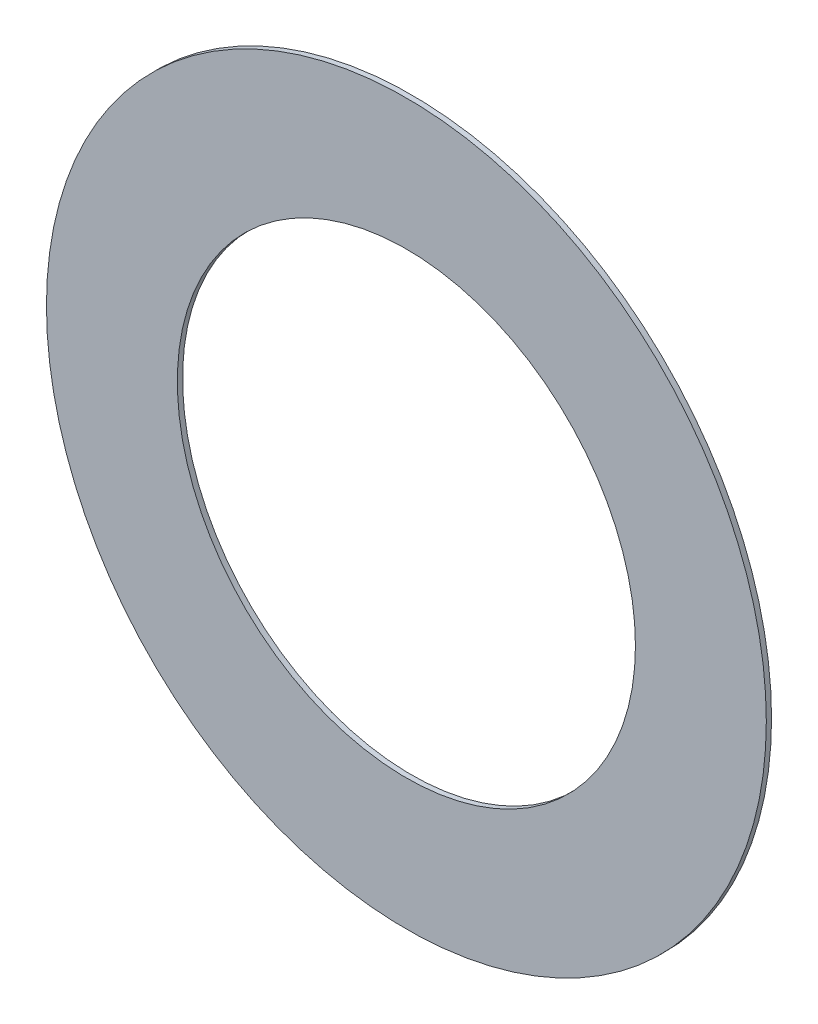
ISO-10303-21;
HEADER;
FILE_DESCRIPTION(('STEP AP214'),'2;1');
FILE_NAME('part.step','',(''),(''),'','','');
FILE_SCHEMA(('AUTOMOTIVE_DESIGN { 1 0 10303 214 1 1 1 1 }'));
ENDSEC;
DATA;
#1=APPLICATION_CONTEXT('core data for automotive mechanical design processes');
#2=APPLICATION_PROTOCOL_DEFINITION('international standard','automotive_design',2000,#1);
#3=PRODUCT_CONTEXT('',#1,'mechanical');
#4=PRODUCT('Part','Part','',(#3));
#5=PRODUCT_RELATED_PRODUCT_CATEGORY('part','',(#4));
#6=PRODUCT_DEFINITION_FORMATION('','',#4);
#7=PRODUCT_DEFINITION_CONTEXT('part definition',#1,'design');
#8=PRODUCT_DEFINITION('design','',#6,#7);
#9=PRODUCT_DEFINITION_SHAPE('','',#8);
#10=(LENGTH_UNIT() NAMED_UNIT(*) SI_UNIT(.MILLI.,.METRE.));
#11=(NAMED_UNIT(*) PLANE_ANGLE_UNIT() SI_UNIT($,.RADIAN.));
#12=(NAMED_UNIT(*) SI_UNIT($,.STERADIAN.) SOLID_ANGLE_UNIT());
#13=UNCERTAINTY_MEASURE_WITH_UNIT(LENGTH_MEASURE(1.E-05),#10,'distance_accuracy_value','');
#14=(GEOMETRIC_REPRESENTATION_CONTEXT(3) GLOBAL_UNCERTAINTY_ASSIGNED_CONTEXT((#13)) GLOBAL_UNIT_ASSIGNED_CONTEXT((#10,
#11,#12)) REPRESENTATION_CONTEXT('',''));
#15=CARTESIAN_POINT('',(0.,0.,0.));
#16=DIRECTION('',(0.,0.,1.));
#17=DIRECTION('',(1.,0.,0.));
#18=AXIS2_PLACEMENT_3D('',#15,#16,#17);
#19=CARTESIAN_POINT('',(0.,0.,0.254));
#20=DIRECTION('',(0.,0.,1.));
#21=DIRECTION('',(1.,0.,0.));
#22=AXIS2_PLACEMENT_3D('',#19,#20,#21);
#23=PLANE('',#22);
#24=CARTESIAN_POINT('',(0.,0.,0.254));
#25=DIRECTION('',(0.,0.,1.));
#26=DIRECTION('',(1.,0.,0.));
#27=AXIS2_PLACEMENT_3D('',#24,#25,#26);
#28=CIRCLE('',#27,17.4625);
#29=CARTESIAN_POINT('',(17.4625,0.,0.254));
#30=VERTEX_POINT('',#29);
#31=EDGE_CURVE('E10',#30,#30,#28,.T.);
#32=ORIENTED_EDGE('',*,*,#31,.T.);
#33=EDGE_LOOP('',(#32));
#34=FACE_BOUND('',#33,.T.);
#35=CARTESIAN_POINT('',(0.,0.,0.254));
#36=DIRECTION('',(0.,0.,1.));
#37=DIRECTION('',(1.,0.,0.));
#38=AXIS2_PLACEMENT_3D('',#35,#36,#37);
#39=CIRCLE('',#38,11.1125);
#40=CARTESIAN_POINT('',(11.1125,0.,0.254));
#41=VERTEX_POINT('',#40);
#42=EDGE_CURVE('E42',#41,#41,#39,.T.);
#43=ORIENTED_EDGE('',*,*,#42,.F.);
#44=EDGE_LOOP('',(#43));
#45=FACE_BOUND('',#44,.T.);
#46=ADVANCED_FACE('F31',(#34,#45),#23,.T.);
#47=CARTESIAN_POINT('',(0.,0.,0.));
#48=DIRECTION('',(0.,0.,1.));
#49=DIRECTION('',(1.,0.,0.));
#50=AXIS2_PLACEMENT_3D('',#47,#48,#49);
#51=PLANE('',#50);
#52=CARTESIAN_POINT('',(0.,0.,0.));
#53=DIRECTION('',(0.,0.,1.));
#54=DIRECTION('',(1.,0.,0.));
#55=AXIS2_PLACEMENT_3D('',#52,#53,#54);
#56=CIRCLE('',#55,17.4625);
#57=CARTESIAN_POINT('',(17.4625,0.,0.));
#58=VERTEX_POINT('',#57);
#59=EDGE_CURVE('E35',#58,#58,#56,.T.);
#60=ORIENTED_EDGE('',*,*,#59,.F.);
#61=EDGE_LOOP('',(#60));
#62=FACE_BOUND('',#61,.T.);
#63=CARTESIAN_POINT('',(0.,0.,0.));
#64=DIRECTION('',(0.,0.,1.));
#65=DIRECTION('',(1.,0.,0.));
#66=AXIS2_PLACEMENT_3D('',#63,#64,#65);
#67=CIRCLE('',#66,11.1125);
#68=CARTESIAN_POINT('',(11.1125,0.,0.));
#69=VERTEX_POINT('',#68);
#70=EDGE_CURVE('E44',#69,#69,#67,.T.);
#71=ORIENTED_EDGE('',*,*,#70,.T.);
#72=EDGE_LOOP('',(#71));
#73=FACE_BOUND('',#72,.T.);
#74=ADVANCED_FACE('F54',(#62,#73),#51,.F.);
#75=CARTESIAN_POINT('',(0.,0.,0.254));
#76=DIRECTION('',(0.,0.,-1.));
#77=DIRECTION('',(-1.,0.,0.));
#78=AXIS2_PLACEMENT_3D('',#75,#76,#77);
#79=CYLINDRICAL_SURFACE('',#78,17.4625);
#80=ORIENTED_EDGE('',*,*,#31,.F.);
#81=EDGE_LOOP('',(#80));
#82=FACE_BOUND('',#81,.T.);
#83=ORIENTED_EDGE('',*,*,#59,.T.);
#84=EDGE_LOOP('',(#83));
#85=FACE_BOUND('',#84,.T.);
#86=ADVANCED_FACE('F33',(#82,#85),#79,.T.);
#87=CARTESIAN_POINT('',(0.,0.,0.254));
#88=DIRECTION('',(0.,0.,-1.));
#89=DIRECTION('',(-1.,0.,0.));
#90=AXIS2_PLACEMENT_3D('',#87,#88,#89);
#91=CYLINDRICAL_SURFACE('',#90,11.1125);
#92=ORIENTED_EDGE('',*,*,#42,.T.);
#93=EDGE_LOOP('',(#92));
#94=FACE_BOUND('',#93,.T.);
#95=ORIENTED_EDGE('',*,*,#70,.F.);
#96=EDGE_LOOP('',(#95));
#97=FACE_BOUND('',#96,.T.);
#98=ADVANCED_FACE('F50',(#94,#97),#91,.F.);
#99=CLOSED_SHELL('',(#46,#74,#86,#98));
#100=MANIFOLD_SOLID_BREP('B2',#99);
#101=ADVANCED_BREP_SHAPE_REPRESENTATION('',(#18,#100),#14);
#102=SHAPE_DEFINITION_REPRESENTATION(#9,#101);
ENDSEC;
END-ISO-10303-21;
